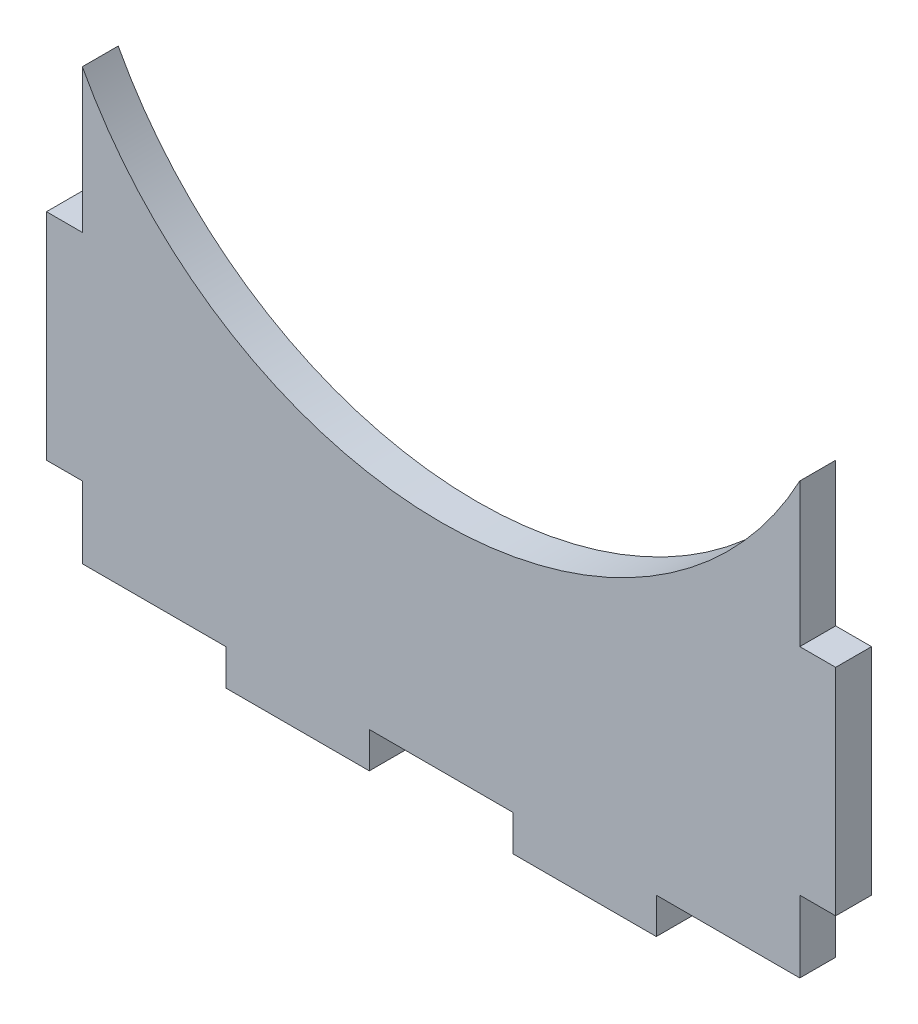
ISO-10303-21;
HEADER;
FILE_DESCRIPTION(('STEP AP214'),'2;1');
FILE_NAME('part.step','',(''),(''),'','','');
FILE_SCHEMA(('AUTOMOTIVE_DESIGN { 1 0 10303 214 1 1 1 1 }'));
ENDSEC;
DATA;
#1=APPLICATION_CONTEXT('core data for automotive mechanical design processes');
#2=APPLICATION_PROTOCOL_DEFINITION('international standard','automotive_design',2000,#1);
#3=PRODUCT_CONTEXT('',#1,'mechanical');
#4=PRODUCT('Part','Part','',(#3));
#5=PRODUCT_RELATED_PRODUCT_CATEGORY('part','',(#4));
#6=PRODUCT_DEFINITION_FORMATION('','',#4);
#7=PRODUCT_DEFINITION_CONTEXT('part definition',#1,'design');
#8=PRODUCT_DEFINITION('design','',#6,#7);
#9=PRODUCT_DEFINITION_SHAPE('','',#8);
#10=(LENGTH_UNIT() NAMED_UNIT(*) SI_UNIT(.MILLI.,.METRE.));
#11=(NAMED_UNIT(*) PLANE_ANGLE_UNIT() SI_UNIT($,.RADIAN.));
#12=(NAMED_UNIT(*) SI_UNIT($,.STERADIAN.) SOLID_ANGLE_UNIT());
#13=UNCERTAINTY_MEASURE_WITH_UNIT(LENGTH_MEASURE(1.E-05),#10,'distance_accuracy_value','');
#14=(GEOMETRIC_REPRESENTATION_CONTEXT(3) GLOBAL_UNCERTAINTY_ASSIGNED_CONTEXT((#13)) GLOBAL_UNIT_ASSIGNED_CONTEXT((#10,
#11,#12)) REPRESENTATION_CONTEXT('',''));
#15=CARTESIAN_POINT('',(0.,0.,0.));
#16=DIRECTION('',(0.,0.,1.));
#17=DIRECTION('',(1.,0.,0.));
#18=AXIS2_PLACEMENT_3D('',#15,#16,#17);
#19=CARTESIAN_POINT('',(0.,116.416666666675,0.));
#20=DIRECTION('',(0.,0.,1.));
#21=DIRECTION('',(1.,0.,0.));
#22=AXIS2_PLACEMENT_3D('',#19,#20,#21);
#23=PLANE('',#22);
#24=DIRECTION('',(0.,-1.,0.));
#25=VECTOR('',#24,1.);
#26=CARTESIAN_POINT('',(-38.0999999999982,6.35,0.));
#27=LINE('',#26,#25);
#28=CARTESIAN_POINT('',(-38.0999999999982,6.35,0.));
#29=VERTEX_POINT('',#28);
#30=CARTESIAN_POINT('',(-38.0999999999982,0.,0.));
#31=VERTEX_POINT('',#30);
#32=EDGE_CURVE('E187',#29,#31,#27,.T.);
#33=ORIENTED_EDGE('',*,*,#32,.F.);
#34=DIRECTION('',(1.,0.,0.));
#35=VECTOR('',#34,1.);
#36=CARTESIAN_POINT('',(-63.5000000000051,6.35000000000001,0.));
#37=LINE('',#36,#35);
#38=CARTESIAN_POINT('',(-63.5000000000051,6.35000000000001,0.));
#39=VERTEX_POINT('',#38);
#40=EDGE_CURVE('E247',#39,#29,#37,.T.);
#41=ORIENTED_EDGE('',*,*,#40,.F.);
#42=DIRECTION('',(0.,-1.,0.));
#43=VECTOR('',#42,1.);
#44=CARTESIAN_POINT('',(-63.5000000000051,6.35000000000001,0.));
#45=LINE('',#44,#43);
#46=CARTESIAN_POINT('',(-63.5000000000051,19.05,0.));
#47=VERTEX_POINT('',#46);
#48=EDGE_CURVE('E244',#47,#39,#45,.T.);
#49=ORIENTED_EDGE('',*,*,#48,.F.);
#50=DIRECTION('',(1.,0.,0.));
#51=VECTOR('',#50,1.);
#52=CARTESIAN_POINT('',(-63.5000000000051,19.05,0.));
#53=LINE('',#52,#51);
#54=CARTESIAN_POINT('',(-69.8500000000051,19.05,0.));
#55=VERTEX_POINT('',#54);
#56=EDGE_CURVE('E241',#55,#47,#53,.T.);
#57=ORIENTED_EDGE('',*,*,#56,.F.);
#58=DIRECTION('',(0.,-1.,0.));
#59=VECTOR('',#58,1.);
#60=CARTESIAN_POINT('',(-69.8500000000051,57.15,0.));
#61=LINE('',#60,#59);
#62=CARTESIAN_POINT('',(-69.8500000000051,57.15,0.));
#63=VERTEX_POINT('',#62);
#64=EDGE_CURVE('E238',#63,#55,#61,.T.);
#65=ORIENTED_EDGE('',*,*,#64,.F.);
#66=DIRECTION('',(-1.,0.,0.));
#67=VECTOR('',#66,1.);
#68=CARTESIAN_POINT('',(-63.5000000000051,57.15,0.));
#69=LINE('',#68,#67);
#70=CARTESIAN_POINT('',(-63.5000000000051,57.15,0.));
#71=VERTEX_POINT('',#70);
#72=EDGE_CURVE('E235',#71,#63,#69,.T.);
#73=ORIENTED_EDGE('',*,*,#72,.F.);
#74=DIRECTION('',(0.,-1.,0.));
#75=VECTOR('',#74,1.);
#76=CARTESIAN_POINT('',(-63.5000000000051,57.15,0.));
#77=LINE('',#76,#75);
#78=CARTESIAN_POINT('',(-63.5000000000051,82.55,0.));
#79=VERTEX_POINT('',#78);
#80=EDGE_CURVE('E232',#79,#71,#77,.T.);
#81=ORIENTED_EDGE('',*,*,#80,.F.);
#82=CARTESIAN_POINT('',(0.,116.416666666675,0.));
#83=DIRECTION('',(0.,0.,-1.));
#84=DIRECTION('',(1.,0.,0.));
#85=AXIS2_PLACEMENT_3D('',#82,#83,#84);
#86=CIRCLE('',#85,71.9666666666752);
#87=CARTESIAN_POINT('',(63.5000000000051,82.55,0.));
#88=VERTEX_POINT('',#87);
#89=EDGE_CURVE('E229',#88,#79,#86,.T.);
#90=ORIENTED_EDGE('',*,*,#89,.F.);
#91=DIRECTION('',(0.,1.,0.));
#92=VECTOR('',#91,1.);
#93=CARTESIAN_POINT('',(63.5000000000051,57.15,0.));
#94=LINE('',#93,#92);
#95=CARTESIAN_POINT('',(63.5000000000051,57.15,0.));
#96=VERTEX_POINT('',#95);
#97=EDGE_CURVE('E226',#96,#88,#94,.T.);
#98=ORIENTED_EDGE('',*,*,#97,.F.);
#99=DIRECTION('',(-1.,0.,0.));
#100=VECTOR('',#99,1.);
#101=CARTESIAN_POINT('',(63.5000000000051,57.15,0.));
#102=LINE('',#101,#100);
#103=CARTESIAN_POINT('',(69.8500000000051,57.15,0.));
#104=VERTEX_POINT('',#103);
#105=EDGE_CURVE('E223',#104,#96,#102,.T.);
#106=ORIENTED_EDGE('',*,*,#105,.F.);
#107=DIRECTION('',(0.,1.,0.));
#108=VECTOR('',#107,1.);
#109=CARTESIAN_POINT('',(69.8500000000051,57.15,0.));
#110=LINE('',#109,#108);
#111=CARTESIAN_POINT('',(69.8500000000051,19.05,0.));
#112=VERTEX_POINT('',#111);
#113=EDGE_CURVE('E220',#112,#104,#110,.T.);
#114=ORIENTED_EDGE('',*,*,#113,.F.);
#115=DIRECTION('',(1.,0.,0.));
#116=VECTOR('',#115,1.);
#117=CARTESIAN_POINT('',(63.5000000000051,19.05,0.));
#118=LINE('',#117,#116);
#119=CARTESIAN_POINT('',(63.5000000000051,19.05,0.));
#120=VERTEX_POINT('',#119);
#121=EDGE_CURVE('E217',#120,#112,#118,.T.);
#122=ORIENTED_EDGE('',*,*,#121,.F.);
#123=DIRECTION('',(0.,1.,0.));
#124=VECTOR('',#123,1.);
#125=CARTESIAN_POINT('',(63.5000000000051,6.35000000000001,0.));
#126=LINE('',#125,#124);
#127=CARTESIAN_POINT('',(63.5000000000051,6.35000000000001,0.));
#128=VERTEX_POINT('',#127);
#129=EDGE_CURVE('E214',#128,#120,#126,.T.);
#130=ORIENTED_EDGE('',*,*,#129,.F.);
#131=DIRECTION('',(1.,0.,0.));
#132=VECTOR('',#131,1.);
#133=CARTESIAN_POINT('',(38.1000000000018,6.35,0.));
#134=LINE('',#133,#132);
#135=CARTESIAN_POINT('',(38.1000000000018,6.35,0.));
#136=VERTEX_POINT('',#135);
#137=EDGE_CURVE('E211',#136,#128,#134,.T.);
#138=ORIENTED_EDGE('',*,*,#137,.F.);
#139=DIRECTION('',(0.,1.,0.));
#140=VECTOR('',#139,1.);
#141=CARTESIAN_POINT('',(38.1000000000018,6.35,0.));
#142=LINE('',#141,#140);
#143=CARTESIAN_POINT('',(38.1000000000018,0.,0.));
#144=VERTEX_POINT('',#143);
#145=EDGE_CURVE('E208',#144,#136,#142,.T.);
#146=ORIENTED_EDGE('',*,*,#145,.F.);
#147=DIRECTION('',(1.,0.,0.));
#148=VECTOR('',#147,1.);
#149=CARTESIAN_POINT('',(38.1000000000018,0.,0.));
#150=LINE('',#149,#148);
#151=CARTESIAN_POINT('',(12.7000000000018,0.,0.));
#152=VERTEX_POINT('',#151);
#153=EDGE_CURVE('E205',#152,#144,#150,.T.);
#154=ORIENTED_EDGE('',*,*,#153,.F.);
#155=DIRECTION('',(0.,-1.,0.));
#156=VECTOR('',#155,1.);
#157=CARTESIAN_POINT('',(12.7000000000018,6.35,0.));
#158=LINE('',#157,#156);
#159=CARTESIAN_POINT('',(12.7000000000018,6.35,0.));
#160=VERTEX_POINT('',#159);
#161=EDGE_CURVE('E202',#160,#152,#158,.T.);
#162=ORIENTED_EDGE('',*,*,#161,.F.);
#163=DIRECTION('',(1.,0.,0.));
#164=VECTOR('',#163,1.);
#165=CARTESIAN_POINT('',(-12.6999999999982,6.35,0.));
#166=LINE('',#165,#164);
#167=CARTESIAN_POINT('',(-12.6999999999982,6.35,0.));
#168=VERTEX_POINT('',#167);
#169=EDGE_CURVE('E199',#168,#160,#166,.T.);
#170=ORIENTED_EDGE('',*,*,#169,.F.);
#171=DIRECTION('',(0.,1.,0.));
#172=VECTOR('',#171,1.);
#173=CARTESIAN_POINT('',(-12.6999999999982,6.35,0.));
#174=LINE('',#173,#172);
#175=CARTESIAN_POINT('',(-12.6999999999982,0.,0.));
#176=VERTEX_POINT('',#175);
#177=EDGE_CURVE('E190',#176,#168,#174,.T.);
#178=ORIENTED_EDGE('',*,*,#177,.F.);
#179=DIRECTION('',(1.,0.,0.));
#180=VECTOR('',#179,1.);
#181=CARTESIAN_POINT('',(-38.0999999999982,0.,0.));
#182=LINE('',#181,#180);
#183=EDGE_CURVE('E179',#31,#176,#182,.T.);
#184=ORIENTED_EDGE('',*,*,#183,.F.);
#185=EDGE_LOOP('',(#33,#41,#49,#57,#65,#73,#81,#90,#98,#106,#114,#122,#130,#138,#146,#154,#162,
#170,#178,#184));
#186=FACE_BOUND('',#185,.T.);
#187=ADVANCED_FACE('F39',(#186),#23,.F.);
#188=CARTESIAN_POINT('',(-63.5000000000051,6.35000000000001,168.617040707604));
#189=DIRECTION('',(0.,1.,0.));
#190=DIRECTION('',(-1.,0.,0.));
#191=AXIS2_PLACEMENT_3D('',#188,#189,#190);
#192=PLANE('',#191);
#193=DIRECTION('',(0.,0.,-1.));
#194=VECTOR('',#193,1.);
#195=CARTESIAN_POINT('',(-38.0999999999982,6.35,168.617040707604));
#196=LINE('',#195,#194);
#197=CARTESIAN_POINT('',(-38.0999999999982,6.35,6.35000000000094));
#198=VERTEX_POINT('',#197);
#199=EDGE_CURVE('E193',#198,#29,#196,.T.);
#200=ORIENTED_EDGE('',*,*,#199,.F.);
#201=DIRECTION('',(-1.,0.,0.));
#202=VECTOR('',#201,1.);
#203=CARTESIAN_POINT('',(-63.5000000000051,6.35000000000001,6.35000000000094));
#204=LINE('',#203,#202);
#205=CARTESIAN_POINT('',(-63.5000000000051,6.35000000000001,6.35000000000094));
#206=VERTEX_POINT('',#205);
#207=EDGE_CURVE('E43',#198,#206,#204,.T.);
#208=ORIENTED_EDGE('',*,*,#207,.T.);
#209=DIRECTION('',(0.,0.,-1.));
#210=VECTOR('',#209,1.);
#211=CARTESIAN_POINT('',(-63.5000000000051,6.35000000000001,168.617040707604));
#212=LINE('',#211,#210);
#213=EDGE_CURVE('E250',#206,#39,#212,.T.);
#214=ORIENTED_EDGE('',*,*,#213,.T.);
#215=ORIENTED_EDGE('',*,*,#40,.T.);
#216=EDGE_LOOP('',(#200,#208,#214,#215));
#217=FACE_BOUND('',#216,.T.);
#218=ADVANCED_FACE('F339',(#217),#192,.F.);
#219=CARTESIAN_POINT('',(-63.5000000000051,6.35000000000001,168.617040707604));
#220=DIRECTION('',(1.,0.,0.));
#221=DIRECTION('',(0.,0.,-1.));
#222=AXIS2_PLACEMENT_3D('',#219,#220,#221);
#223=PLANE('',#222);
#224=ORIENTED_EDGE('',*,*,#213,.F.);
#225=DIRECTION('',(0.,1.,0.));
#226=VECTOR('',#225,1.);
#227=CARTESIAN_POINT('',(-63.5000000000051,6.35,6.35000000000094));
#228=LINE('',#227,#226);
#229=CARTESIAN_POINT('',(-63.5000000000051,19.05,6.35000000000094));
#230=VERTEX_POINT('',#229);
#231=EDGE_CURVE('E333',#206,#230,#228,.T.);
#232=ORIENTED_EDGE('',*,*,#231,.T.);
#233=DIRECTION('',(0.,0.,-1.));
#234=VECTOR('',#233,1.);
#235=CARTESIAN_POINT('',(-63.5000000000051,19.05,168.617040707604));
#236=LINE('',#235,#234);
#237=EDGE_CURVE('E252',#230,#47,#236,.T.);
#238=ORIENTED_EDGE('',*,*,#237,.T.);
#239=ORIENTED_EDGE('',*,*,#48,.T.);
#240=EDGE_LOOP('',(#224,#232,#238,#239));
#241=FACE_BOUND('',#240,.T.);
#242=ADVANCED_FACE('F342',(#241),#223,.F.);
#243=CARTESIAN_POINT('',(-63.5000000000051,19.05,168.617040707604));
#244=DIRECTION('',(0.,1.,0.));
#245=DIRECTION('',(0.,0.,1.));
#246=AXIS2_PLACEMENT_3D('',#243,#244,#245);
#247=PLANE('',#246);
#248=ORIENTED_EDGE('',*,*,#237,.F.);
#249=DIRECTION('',(-1.,0.,0.));
#250=VECTOR('',#249,1.);
#251=CARTESIAN_POINT('',(-63.5000000000051,19.05,6.35000000000094));
#252=LINE('',#251,#250);
#253=CARTESIAN_POINT('',(-69.8500000000051,19.05,6.35000000000094));
#254=VERTEX_POINT('',#253);
#255=EDGE_CURVE('E330',#230,#254,#252,.T.);
#256=ORIENTED_EDGE('',*,*,#255,.T.);
#257=DIRECTION('',(0.,0.,-1.));
#258=VECTOR('',#257,1.);
#259=CARTESIAN_POINT('',(-69.8500000000051,19.05,168.617040707604));
#260=LINE('',#259,#258);
#261=EDGE_CURVE('E254',#254,#55,#260,.T.);
#262=ORIENTED_EDGE('',*,*,#261,.T.);
#263=ORIENTED_EDGE('',*,*,#56,.T.);
#264=EDGE_LOOP('',(#248,#256,#262,#263));
#265=FACE_BOUND('',#264,.T.);
#266=ADVANCED_FACE('F348',(#265),#247,.F.);
#267=CARTESIAN_POINT('',(-69.8500000000051,57.15,168.617040707604));
#268=DIRECTION('',(1.,0.,0.));
#269=DIRECTION('',(0.,1.,0.));
#270=AXIS2_PLACEMENT_3D('',#267,#268,#269);
#271=PLANE('',#270);
#272=ORIENTED_EDGE('',*,*,#261,.F.);
#273=DIRECTION('',(0.,1.,0.));
#274=VECTOR('',#273,1.);
#275=CARTESIAN_POINT('',(-69.8500000000051,57.15,6.35000000000094));
#276=LINE('',#275,#274);
#277=CARTESIAN_POINT('',(-69.8500000000051,57.15,6.35000000000094));
#278=VERTEX_POINT('',#277);
#279=EDGE_CURVE('E327',#254,#278,#276,.T.);
#280=ORIENTED_EDGE('',*,*,#279,.T.);
#281=DIRECTION('',(0.,0.,-1.));
#282=VECTOR('',#281,1.);
#283=CARTESIAN_POINT('',(-69.8500000000051,57.15,168.617040707604));
#284=LINE('',#283,#282);
#285=EDGE_CURVE('E256',#278,#63,#284,.T.);
#286=ORIENTED_EDGE('',*,*,#285,.T.);
#287=ORIENTED_EDGE('',*,*,#64,.T.);
#288=EDGE_LOOP('',(#272,#280,#286,#287));
#289=FACE_BOUND('',#288,.T.);
#290=ADVANCED_FACE('F351',(#289),#271,.F.);
#291=CARTESIAN_POINT('',(-63.5000000000051,57.15,168.617040707604));
#292=DIRECTION('',(0.,-1.,0.));
#293=DIRECTION('',(0.,0.,-1.));
#294=AXIS2_PLACEMENT_3D('',#291,#292,#293);
#295=PLANE('',#294);
#296=ORIENTED_EDGE('',*,*,#285,.F.);
#297=DIRECTION('',(1.,0.,0.));
#298=VECTOR('',#297,1.);
#299=CARTESIAN_POINT('',(-63.5000000000051,57.15,6.35000000000094));
#300=LINE('',#299,#298);
#301=CARTESIAN_POINT('',(-63.5000000000051,57.15,6.35000000000094));
#302=VERTEX_POINT('',#301);
#303=EDGE_CURVE('E324',#278,#302,#300,.T.);
#304=ORIENTED_EDGE('',*,*,#303,.T.);
#305=DIRECTION('',(0.,0.,-1.));
#306=VECTOR('',#305,1.);
#307=CARTESIAN_POINT('',(-63.5000000000051,57.15,168.617040707604));
#308=LINE('',#307,#306);
#309=EDGE_CURVE('E258',#302,#71,#308,.T.);
#310=ORIENTED_EDGE('',*,*,#309,.T.);
#311=ORIENTED_EDGE('',*,*,#72,.T.);
#312=EDGE_LOOP('',(#296,#304,#310,#311));
#313=FACE_BOUND('',#312,.T.);
#314=ADVANCED_FACE('F354',(#313),#295,.F.);
#315=CARTESIAN_POINT('',(-63.5000000000051,57.15,168.617040707604));
#316=DIRECTION('',(1.,0.,0.));
#317=DIRECTION('',(0.,0.,-1.));
#318=AXIS2_PLACEMENT_3D('',#315,#316,#317);
#319=PLANE('',#318);
#320=ORIENTED_EDGE('',*,*,#309,.F.);
#321=DIRECTION('',(0.,1.,0.));
#322=VECTOR('',#321,1.);
#323=CARTESIAN_POINT('',(-63.5000000000051,57.15,6.35000000000094));
#324=LINE('',#323,#322);
#325=CARTESIAN_POINT('',(-63.5000000000051,82.55,6.35000000000094));
#326=VERTEX_POINT('',#325);
#327=EDGE_CURVE('E321',#302,#326,#324,.T.);
#328=ORIENTED_EDGE('',*,*,#327,.T.);
#329=DIRECTION('',(0.,0.,-1.));
#330=VECTOR('',#329,1.);
#331=CARTESIAN_POINT('',(-63.5000000000051,82.55,168.617040707604));
#332=LINE('',#331,#330);
#333=EDGE_CURVE('E260',#326,#79,#332,.T.);
#334=ORIENTED_EDGE('',*,*,#333,.T.);
#335=ORIENTED_EDGE('',*,*,#80,.T.);
#336=EDGE_LOOP('',(#320,#328,#334,#335));
#337=FACE_BOUND('',#336,.T.);
#338=ADVANCED_FACE('F360',(#337),#319,.F.);
#339=CARTESIAN_POINT('',(0.,116.416666666675,168.617040707604));
#340=DIRECTION('',(0.,0.,-1.));
#341=DIRECTION('',(-1.,0.,0.));
#342=AXIS2_PLACEMENT_3D('',#339,#340,#341);
#343=CYLINDRICAL_SURFACE('',#342,71.9666666666752);
#344=ORIENTED_EDGE('',*,*,#333,.F.);
#345=CARTESIAN_POINT('',(0.,116.416666666675,6.35000000000094));
#346=DIRECTION('',(0.,0.,-1.));
#347=DIRECTION('',(0.,1.,0.));
#348=AXIS2_PLACEMENT_3D('',#345,#346,#347);
#349=CIRCLE('',#348,71.9666666666752);
#350=CARTESIAN_POINT('',(63.5000000000051,82.55,6.35000000000094));
#351=VERTEX_POINT('',#350);
#352=EDGE_CURVE('E318',#326,#351,#349,.F.);
#353=ORIENTED_EDGE('',*,*,#352,.T.);
#354=DIRECTION('',(0.,0.,-1.));
#355=VECTOR('',#354,1.);
#356=CARTESIAN_POINT('',(63.5000000000051,82.55,168.617040707604));
#357=LINE('',#356,#355);
#358=EDGE_CURVE('E262',#351,#88,#357,.T.);
#359=ORIENTED_EDGE('',*,*,#358,.T.);
#360=ORIENTED_EDGE('',*,*,#89,.T.);
#361=EDGE_LOOP('',(#344,#353,#359,#360));
#362=FACE_BOUND('',#361,.T.);
#363=ADVANCED_FACE('F363',(#362),#343,.F.);
#364=CARTESIAN_POINT('',(63.5000000000051,57.15,168.617040707604));
#365=DIRECTION('',(-1.,0.,0.));
#366=DIRECTION('',(0.,0.,1.));
#367=AXIS2_PLACEMENT_3D('',#364,#365,#366);
#368=PLANE('',#367);
#369=ORIENTED_EDGE('',*,*,#358,.F.);
#370=DIRECTION('',(0.,-1.,0.));
#371=VECTOR('',#370,1.);
#372=CARTESIAN_POINT('',(63.5000000000051,57.15,6.35000000000094));
#373=LINE('',#372,#371);
#374=CARTESIAN_POINT('',(63.5000000000051,57.15,6.35000000000094));
#375=VERTEX_POINT('',#374);
#376=EDGE_CURVE('E315',#351,#375,#373,.T.);
#377=ORIENTED_EDGE('',*,*,#376,.T.);
#378=DIRECTION('',(0.,0.,-1.));
#379=VECTOR('',#378,1.);
#380=CARTESIAN_POINT('',(63.5000000000051,57.15,168.617040707604));
#381=LINE('',#380,#379);
#382=EDGE_CURVE('E264',#375,#96,#381,.T.);
#383=ORIENTED_EDGE('',*,*,#382,.T.);
#384=ORIENTED_EDGE('',*,*,#97,.T.);
#385=EDGE_LOOP('',(#369,#377,#383,#384));
#386=FACE_BOUND('',#385,.T.);
#387=ADVANCED_FACE('F366',(#386),#368,.F.);
#388=CARTESIAN_POINT('',(63.5000000000051,57.15,168.617040707604));
#389=DIRECTION('',(0.,-1.,0.));
#390=DIRECTION('',(0.,0.,-1.));
#391=AXIS2_PLACEMENT_3D('',#388,#389,#390);
#392=PLANE('',#391);
#393=ORIENTED_EDGE('',*,*,#382,.F.);
#394=DIRECTION('',(1.,0.,0.));
#395=VECTOR('',#394,1.);
#396=CARTESIAN_POINT('',(63.5000000000051,57.15,6.35000000000094));
#397=LINE('',#396,#395);
#398=CARTESIAN_POINT('',(69.8500000000051,57.15,6.35000000000094));
#399=VERTEX_POINT('',#398);
#400=EDGE_CURVE('E312',#375,#399,#397,.T.);
#401=ORIENTED_EDGE('',*,*,#400,.T.);
#402=DIRECTION('',(0.,0.,-1.));
#403=VECTOR('',#402,1.);
#404=CARTESIAN_POINT('',(69.8500000000051,57.15,168.617040707604));
#405=LINE('',#404,#403);
#406=EDGE_CURVE('E266',#399,#104,#405,.T.);
#407=ORIENTED_EDGE('',*,*,#406,.T.);
#408=ORIENTED_EDGE('',*,*,#105,.T.);
#409=EDGE_LOOP('',(#393,#401,#407,#408));
#410=FACE_BOUND('',#409,.T.);
#411=ADVANCED_FACE('F372',(#410),#392,.F.);
#412=CARTESIAN_POINT('',(69.8500000000051,57.15,168.617040707604));
#413=DIRECTION('',(-1.,0.,0.));
#414=DIRECTION('',(0.,-1.,0.));
#415=AXIS2_PLACEMENT_3D('',#412,#413,#414);
#416=PLANE('',#415);
#417=ORIENTED_EDGE('',*,*,#406,.F.);
#418=DIRECTION('',(0.,-1.,0.));
#419=VECTOR('',#418,1.);
#420=CARTESIAN_POINT('',(69.8500000000051,57.15,6.35000000000094));
#421=LINE('',#420,#419);
#422=CARTESIAN_POINT('',(69.8500000000051,19.05,6.35000000000094));
#423=VERTEX_POINT('',#422);
#424=EDGE_CURVE('E309',#399,#423,#421,.T.);
#425=ORIENTED_EDGE('',*,*,#424,.T.);
#426=DIRECTION('',(0.,0.,-1.));
#427=VECTOR('',#426,1.);
#428=CARTESIAN_POINT('',(69.8500000000051,19.05,168.617040707604));
#429=LINE('',#428,#427);
#430=EDGE_CURVE('E268',#423,#112,#429,.T.);
#431=ORIENTED_EDGE('',*,*,#430,.T.);
#432=ORIENTED_EDGE('',*,*,#113,.T.);
#433=EDGE_LOOP('',(#417,#425,#431,#432));
#434=FACE_BOUND('',#433,.T.);
#435=ADVANCED_FACE('F375',(#434),#416,.F.);
#436=CARTESIAN_POINT('',(63.5000000000051,19.05,168.617040707604));
#437=DIRECTION('',(0.,1.,0.));
#438=DIRECTION('',(0.,0.,1.));
#439=AXIS2_PLACEMENT_3D('',#436,#437,#438);
#440=PLANE('',#439);
#441=ORIENTED_EDGE('',*,*,#430,.F.);
#442=DIRECTION('',(-1.,0.,0.));
#443=VECTOR('',#442,1.);
#444=CARTESIAN_POINT('',(63.5000000000051,19.05,6.35000000000094));
#445=LINE('',#444,#443);
#446=CARTESIAN_POINT('',(63.5000000000051,19.05,6.35000000000094));
#447=VERTEX_POINT('',#446);
#448=EDGE_CURVE('E306',#423,#447,#445,.T.);
#449=ORIENTED_EDGE('',*,*,#448,.T.);
#450=DIRECTION('',(0.,0.,-1.));
#451=VECTOR('',#450,1.);
#452=CARTESIAN_POINT('',(63.5000000000051,19.05,168.617040707604));
#453=LINE('',#452,#451);
#454=EDGE_CURVE('E270',#447,#120,#453,.T.);
#455=ORIENTED_EDGE('',*,*,#454,.T.);
#456=ORIENTED_EDGE('',*,*,#121,.T.);
#457=EDGE_LOOP('',(#441,#449,#455,#456));
#458=FACE_BOUND('',#457,.T.);
#459=ADVANCED_FACE('F378',(#458),#440,.F.);
#460=CARTESIAN_POINT('',(63.5000000000051,6.35000000000001,168.617040707604));
#461=DIRECTION('',(-1.,0.,0.));
#462=DIRECTION('',(0.,0.,1.));
#463=AXIS2_PLACEMENT_3D('',#460,#461,#462);
#464=PLANE('',#463);
#465=ORIENTED_EDGE('',*,*,#454,.F.);
#466=DIRECTION('',(0.,-1.,0.));
#467=VECTOR('',#466,1.);
#468=CARTESIAN_POINT('',(63.5000000000051,6.35,6.35000000000094));
#469=LINE('',#468,#467);
#470=CARTESIAN_POINT('',(63.5000000000051,6.35000000000001,6.35000000000094));
#471=VERTEX_POINT('',#470);
#472=EDGE_CURVE('E303',#447,#471,#469,.T.);
#473=ORIENTED_EDGE('',*,*,#472,.T.);
#474=DIRECTION('',(0.,0.,-1.));
#475=VECTOR('',#474,1.);
#476=CARTESIAN_POINT('',(63.5000000000051,6.35000000000001,168.617040707604));
#477=LINE('',#476,#475);
#478=EDGE_CURVE('E272',#471,#128,#477,.T.);
#479=ORIENTED_EDGE('',*,*,#478,.T.);
#480=ORIENTED_EDGE('',*,*,#129,.T.);
#481=EDGE_LOOP('',(#465,#473,#479,#480));
#482=FACE_BOUND('',#481,.T.);
#483=ADVANCED_FACE('F384',(#482),#464,.F.);
#484=CARTESIAN_POINT('',(38.1000000000018,6.35,168.617040707604));
#485=DIRECTION('',(0.,1.,0.));
#486=DIRECTION('',(-1.,0.,0.));
#487=AXIS2_PLACEMENT_3D('',#484,#485,#486);
#488=PLANE('',#487);
#489=ORIENTED_EDGE('',*,*,#478,.F.);
#490=DIRECTION('',(-1.,0.,0.));
#491=VECTOR('',#490,1.);
#492=CARTESIAN_POINT('',(38.1000000000018,6.35,6.35000000000094));
#493=LINE('',#492,#491);
#494=CARTESIAN_POINT('',(38.1000000000018,6.35,6.35000000000094));
#495=VERTEX_POINT('',#494);
#496=EDGE_CURVE('E300',#471,#495,#493,.T.);
#497=ORIENTED_EDGE('',*,*,#496,.T.);
#498=DIRECTION('',(0.,0.,-1.));
#499=VECTOR('',#498,1.);
#500=CARTESIAN_POINT('',(38.1000000000018,6.35,168.617040707604));
#501=LINE('',#500,#499);
#502=EDGE_CURVE('E274',#495,#136,#501,.T.);
#503=ORIENTED_EDGE('',*,*,#502,.T.);
#504=ORIENTED_EDGE('',*,*,#137,.T.);
#505=EDGE_LOOP('',(#489,#497,#503,#504));
#506=FACE_BOUND('',#505,.T.);
#507=ADVANCED_FACE('F387',(#506),#488,.F.);
#508=CARTESIAN_POINT('',(38.1000000000018,6.35,168.617040707604));
#509=DIRECTION('',(-1.,0.,0.));
#510=DIRECTION('',(0.,0.,1.));
#511=AXIS2_PLACEMENT_3D('',#508,#509,#510);
#512=PLANE('',#511);
#513=ORIENTED_EDGE('',*,*,#502,.F.);
#514=DIRECTION('',(0.,-1.,0.));
#515=VECTOR('',#514,1.);
#516=CARTESIAN_POINT('',(38.1000000000018,6.35,6.35000000000094));
#517=LINE('',#516,#515);
#518=CARTESIAN_POINT('',(38.1000000000018,0.,6.35000000000094));
#519=VERTEX_POINT('',#518);
#520=EDGE_CURVE('E297',#495,#519,#517,.T.);
#521=ORIENTED_EDGE('',*,*,#520,.T.);
#522=DIRECTION('',(0.,0.,-1.));
#523=VECTOR('',#522,1.);
#524=CARTESIAN_POINT('',(38.1000000000018,0.,168.617040707604));
#525=LINE('',#524,#523);
#526=EDGE_CURVE('E276',#519,#144,#525,.T.);
#527=ORIENTED_EDGE('',*,*,#526,.T.);
#528=ORIENTED_EDGE('',*,*,#145,.T.);
#529=EDGE_LOOP('',(#513,#521,#527,#528));
#530=FACE_BOUND('',#529,.T.);
#531=ADVANCED_FACE('F390',(#530),#512,.F.);
#532=CARTESIAN_POINT('',(38.1000000000018,0.,168.617040707604));
#533=DIRECTION('',(0.,1.,0.));
#534=DIRECTION('',(-1.,0.,0.));
#535=AXIS2_PLACEMENT_3D('',#532,#533,#534);
#536=PLANE('',#535);
#537=ORIENTED_EDGE('',*,*,#526,.F.);
#538=DIRECTION('',(-1.,0.,0.));
#539=VECTOR('',#538,1.);
#540=CARTESIAN_POINT('',(38.1000000000018,0.,6.35000000000094));
#541=LINE('',#540,#539);
#542=CARTESIAN_POINT('',(12.7000000000018,0.,6.35000000000094));
#543=VERTEX_POINT('',#542);
#544=EDGE_CURVE('E294',#519,#543,#541,.T.);
#545=ORIENTED_EDGE('',*,*,#544,.T.);
#546=DIRECTION('',(0.,0.,-1.));
#547=VECTOR('',#546,1.);
#548=CARTESIAN_POINT('',(12.7000000000018,0.,168.617040707604));
#549=LINE('',#548,#547);
#550=EDGE_CURVE('E278',#543,#152,#549,.T.);
#551=ORIENTED_EDGE('',*,*,#550,.T.);
#552=ORIENTED_EDGE('',*,*,#153,.T.);
#553=EDGE_LOOP('',(#537,#545,#551,#552));
#554=FACE_BOUND('',#553,.T.);
#555=ADVANCED_FACE('F395',(#554),#536,.F.);
#556=CARTESIAN_POINT('',(12.7000000000018,6.35,168.617040707604));
#557=DIRECTION('',(1.,0.,0.));
#558=DIRECTION('',(0.,0.,-1.));
#559=AXIS2_PLACEMENT_3D('',#556,#557,#558);
#560=PLANE('',#559);
#561=ORIENTED_EDGE('',*,*,#550,.F.);
#562=DIRECTION('',(0.,1.,0.));
#563=VECTOR('',#562,1.);
#564=CARTESIAN_POINT('',(12.7000000000018,6.35,6.35000000000094));
#565=LINE('',#564,#563);
#566=CARTESIAN_POINT('',(12.7000000000018,6.35,6.35000000000094));
#567=VERTEX_POINT('',#566);
#568=EDGE_CURVE('E289',#543,#567,#565,.T.);
#569=ORIENTED_EDGE('',*,*,#568,.T.);
#570=DIRECTION('',(0.,0.,-1.));
#571=VECTOR('',#570,1.);
#572=CARTESIAN_POINT('',(12.7000000000018,6.35,168.617040707604));
#573=LINE('',#572,#571);
#574=EDGE_CURVE('E280',#567,#160,#573,.T.);
#575=ORIENTED_EDGE('',*,*,#574,.T.);
#576=ORIENTED_EDGE('',*,*,#161,.T.);
#577=EDGE_LOOP('',(#561,#569,#575,#576));
#578=FACE_BOUND('',#577,.T.);
#579=ADVANCED_FACE('F398',(#578),#560,.F.);
#580=CARTESIAN_POINT('',(-12.6999999999982,6.35,168.617040707604));
#581=DIRECTION('',(0.,1.,0.));
#582=DIRECTION('',(0.,0.,1.));
#583=AXIS2_PLACEMENT_3D('',#580,#581,#582);
#584=PLANE('',#583);
#585=ORIENTED_EDGE('',*,*,#574,.F.);
#586=DIRECTION('',(-1.,0.,0.));
#587=VECTOR('',#586,1.);
#588=CARTESIAN_POINT('',(-12.6999999999982,6.35,6.35000000000094));
#589=LINE('',#588,#587);
#590=CARTESIAN_POINT('',(-12.6999999999982,6.35,6.35000000000094));
#591=VERTEX_POINT('',#590);
#592=EDGE_CURVE('E287',#567,#591,#589,.T.);
#593=ORIENTED_EDGE('',*,*,#592,.T.);
#594=DIRECTION('',(0.,0.,-1.));
#595=VECTOR('',#594,1.);
#596=CARTESIAN_POINT('',(-12.6999999999982,6.35,168.617040707604));
#597=LINE('',#596,#595);
#598=EDGE_CURVE('E282',#591,#168,#597,.T.);
#599=ORIENTED_EDGE('',*,*,#598,.T.);
#600=ORIENTED_EDGE('',*,*,#169,.T.);
#601=EDGE_LOOP('',(#585,#593,#599,#600));
#602=FACE_BOUND('',#601,.T.);
#603=ADVANCED_FACE('F401',(#602),#584,.F.);
#604=CARTESIAN_POINT('',(-12.6999999999982,6.35,168.617040707604));
#605=DIRECTION('',(-1.,0.,0.));
#606=DIRECTION('',(0.,0.,1.));
#607=AXIS2_PLACEMENT_3D('',#604,#605,#606);
#608=PLANE('',#607);
#609=ORIENTED_EDGE('',*,*,#598,.F.);
#610=DIRECTION('',(0.,-1.,0.));
#611=VECTOR('',#610,1.);
#612=CARTESIAN_POINT('',(-12.6999999999982,6.35,6.35000000000094));
#613=LINE('',#612,#611);
#614=CARTESIAN_POINT('',(-12.6999999999982,0.,6.35000000000094));
#615=VERTEX_POINT('',#614);
#616=EDGE_CURVE('E60',#591,#615,#613,.T.);
#617=ORIENTED_EDGE('',*,*,#616,.T.);
#618=DIRECTION('',(0.,0.,-1.));
#619=VECTOR('',#618,1.);
#620=CARTESIAN_POINT('',(-12.6999999999982,0.,168.617040707604));
#621=LINE('',#620,#619);
#622=EDGE_CURVE('E183',#615,#176,#621,.T.);
#623=ORIENTED_EDGE('',*,*,#622,.T.);
#624=ORIENTED_EDGE('',*,*,#177,.T.);
#625=EDGE_LOOP('',(#609,#617,#623,#624));
#626=FACE_BOUND('',#625,.T.);
#627=ADVANCED_FACE('F285',(#626),#608,.F.);
#628=CARTESIAN_POINT('',(-38.0999999999982,0.,168.617040707604));
#629=DIRECTION('',(0.,1.,0.));
#630=DIRECTION('',(-1.,0.,0.));
#631=AXIS2_PLACEMENT_3D('',#628,#629,#630);
#632=PLANE('',#631);
#633=ORIENTED_EDGE('',*,*,#622,.F.);
#634=DIRECTION('',(-1.,0.,0.));
#635=VECTOR('',#634,1.);
#636=CARTESIAN_POINT('',(-38.0999999999982,0.,6.35000000000094));
#637=LINE('',#636,#635);
#638=CARTESIAN_POINT('',(-38.0999999999982,0.,6.35000000000094));
#639=VERTEX_POINT('',#638);
#640=EDGE_CURVE('E48',#615,#639,#637,.T.);
#641=ORIENTED_EDGE('',*,*,#640,.T.);
#642=DIRECTION('',(0.,0.,-1.));
#643=VECTOR('',#642,1.);
#644=CARTESIAN_POINT('',(-38.0999999999982,0.,168.617040707604));
#645=LINE('',#644,#643);
#646=EDGE_CURVE('E176',#639,#31,#645,.T.);
#647=ORIENTED_EDGE('',*,*,#646,.T.);
#648=ORIENTED_EDGE('',*,*,#183,.T.);
#649=EDGE_LOOP('',(#633,#641,#647,#648));
#650=FACE_BOUND('',#649,.T.);
#651=ADVANCED_FACE('F178',(#650),#632,.F.);
#652=CARTESIAN_POINT('',(-38.0999999999982,6.35,168.617040707604));
#653=DIRECTION('',(1.,0.,0.));
#654=DIRECTION('',(0.,0.,-1.));
#655=AXIS2_PLACEMENT_3D('',#652,#653,#654);
#656=PLANE('',#655);
#657=ORIENTED_EDGE('',*,*,#646,.F.);
#658=DIRECTION('',(0.,1.,0.));
#659=VECTOR('',#658,1.);
#660=CARTESIAN_POINT('',(-38.0999999999982,6.35,6.35000000000094));
#661=LINE('',#660,#659);
#662=EDGE_CURVE('E11',#639,#198,#661,.T.);
#663=ORIENTED_EDGE('',*,*,#662,.T.);
#664=ORIENTED_EDGE('',*,*,#199,.T.);
#665=ORIENTED_EDGE('',*,*,#32,.T.);
#666=EDGE_LOOP('',(#657,#663,#664,#665));
#667=FACE_BOUND('',#666,.T.);
#668=ADVANCED_FACE('F41',(#667),#656,.F.);
#669=CARTESIAN_POINT('',(38.0999999999999,6.35000000000001,6.35000000000094));
#670=DIRECTION('',(0.,0.,-1.));
#671=DIRECTION('',(-1.,0.,0.));
#672=AXIS2_PLACEMENT_3D('',#669,#670,#671);
#673=PLANE('',#672);
#674=ORIENTED_EDGE('',*,*,#640,.F.);
#675=ORIENTED_EDGE('',*,*,#616,.F.);
#676=ORIENTED_EDGE('',*,*,#592,.F.);
#677=ORIENTED_EDGE('',*,*,#568,.F.);
#678=ORIENTED_EDGE('',*,*,#544,.F.);
#679=ORIENTED_EDGE('',*,*,#520,.F.);
#680=ORIENTED_EDGE('',*,*,#496,.F.);
#681=ORIENTED_EDGE('',*,*,#472,.F.);
#682=ORIENTED_EDGE('',*,*,#448,.F.);
#683=ORIENTED_EDGE('',*,*,#424,.F.);
#684=ORIENTED_EDGE('',*,*,#400,.F.);
#685=ORIENTED_EDGE('',*,*,#376,.F.);
#686=ORIENTED_EDGE('',*,*,#352,.F.);
#687=ORIENTED_EDGE('',*,*,#327,.F.);
#688=ORIENTED_EDGE('',*,*,#303,.F.);
#689=ORIENTED_EDGE('',*,*,#279,.F.);
#690=ORIENTED_EDGE('',*,*,#255,.F.);
#691=ORIENTED_EDGE('',*,*,#231,.F.);
#692=ORIENTED_EDGE('',*,*,#207,.F.);
#693=ORIENTED_EDGE('',*,*,#662,.F.);
#694=EDGE_LOOP('',(#674,#675,#676,#677,#678,#679,#680,#681,#682,#683,#684,#685,#686,#687,#688,
#689,#690,#691,#692,#693));
#695=FACE_BOUND('',#694,.T.);
#696=ADVANCED_FACE('F340',(#695),#673,.F.);
#697=CLOSED_SHELL('',(#187,#218,#242,#266,#290,#314,#338,#363,#387,#411,#435,#459,#483,#507,
#531,#555,#579,#603,#627,#651,#668,#696));
#698=MANIFOLD_SOLID_BREP('B2',#697);
#699=ADVANCED_BREP_SHAPE_REPRESENTATION('',(#18,#698),#14);
#700=SHAPE_DEFINITION_REPRESENTATION(#9,#699);
ENDSEC;
END-ISO-10303-21;
